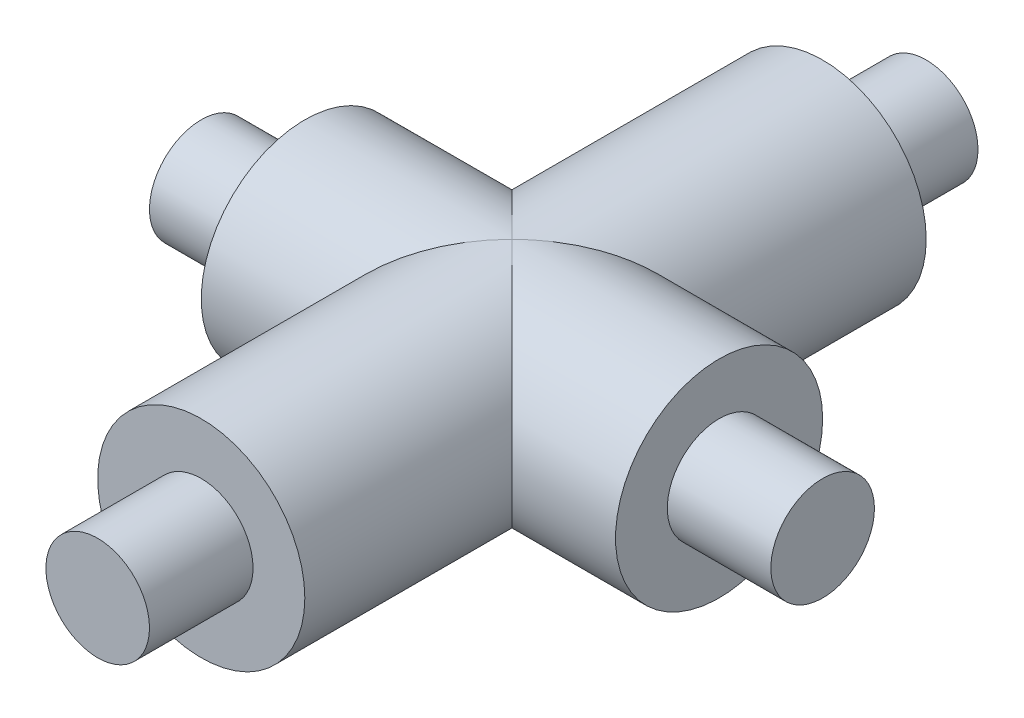
ISO-10303-21;
HEADER;
FILE_DESCRIPTION(('STEP AP214'),'2;1');
FILE_NAME('part.step','',(''),(''),'','','');
FILE_SCHEMA(('AUTOMOTIVE_DESIGN { 1 0 10303 214 1 1 1 1 }'));
ENDSEC;
DATA;
#1=APPLICATION_CONTEXT('core data for automotive mechanical design processes');
#2=APPLICATION_PROTOCOL_DEFINITION('international standard','automotive_design',2000,#1);
#3=PRODUCT_CONTEXT('',#1,'mechanical');
#4=PRODUCT('Part','Part','',(#3));
#5=PRODUCT_RELATED_PRODUCT_CATEGORY('part','',(#4));
#6=PRODUCT_DEFINITION_FORMATION('','',#4);
#7=PRODUCT_DEFINITION_CONTEXT('part definition',#1,'design');
#8=PRODUCT_DEFINITION('design','',#6,#7);
#9=PRODUCT_DEFINITION_SHAPE('','',#8);
#10=(LENGTH_UNIT() NAMED_UNIT(*) SI_UNIT(.MILLI.,.METRE.));
#11=(NAMED_UNIT(*) PLANE_ANGLE_UNIT() SI_UNIT($,.RADIAN.));
#12=(NAMED_UNIT(*) SI_UNIT($,.STERADIAN.) SOLID_ANGLE_UNIT());
#13=UNCERTAINTY_MEASURE_WITH_UNIT(LENGTH_MEASURE(1.E-05),#10,'distance_accuracy_value','');
#14=(GEOMETRIC_REPRESENTATION_CONTEXT(3) GLOBAL_UNCERTAINTY_ASSIGNED_CONTEXT((#13)) GLOBAL_UNIT_ASSIGNED_CONTEXT((#10,
#11,#12)) REPRESENTATION_CONTEXT('',''));
#15=CARTESIAN_POINT('',(0.,0.,0.));
#16=DIRECTION('',(0.,0.,1.));
#17=DIRECTION('',(1.,0.,0.));
#18=AXIS2_PLACEMENT_3D('',#15,#16,#17);
#19=CARTESIAN_POINT('',(0.,0.,-30.));
#20=DIRECTION('',(0.,0.,1.));
#21=DIRECTION('',(1.,0.,0.));
#22=AXIS2_PLACEMENT_3D('',#19,#20,#21);
#23=CYLINDRICAL_SURFACE('',#22,5.);
#24=CARTESIAN_POINT('',(0.,0.,-15.));
#25=DIRECTION('',(0.707106781186547,0.,0.707106781186547));
#26=DIRECTION('',(-0.707106781186547,0.,0.707106781186547));
#27=AXIS2_PLACEMENT_3D('',#24,#25,#26);
#28=ELLIPSE('',#27,7.07106781186547,5.);
#29=CARTESIAN_POINT('',(0.,-5.,-15.));
#30=VERTEX_POINT('',#29);
#31=CARTESIAN_POINT('',(0.,5.,-15.));
#32=VERTEX_POINT('',#31);
#33=EDGE_CURVE('E61',#30,#32,#28,.T.);
#34=ORIENTED_EDGE('',*,*,#33,.F.);
#35=CARTESIAN_POINT('',(0.,0.,-15.));
#36=DIRECTION('',(-0.707106781186547,0.,0.707106781186547));
#37=DIRECTION('',(0.707106781186547,0.,0.707106781186547));
#38=AXIS2_PLACEMENT_3D('',#35,#36,#37);
#39=ELLIPSE('',#38,7.07106781186547,5.);
#40=EDGE_CURVE('E59',#32,#30,#39,.T.);
#41=ORIENTED_EDGE('',*,*,#40,.F.);
#42=EDGE_LOOP('',(#34,#41));
#43=FACE_BOUND('',#42,.T.);
#44=CARTESIAN_POINT('',(0.,0.,-30.));
#45=DIRECTION('',(0.,0.,1.));
#46=DIRECTION('',(1.,0.,0.));
#47=AXIS2_PLACEMENT_3D('',#44,#45,#46);
#48=CIRCLE('',#47,5.);
#49=CARTESIAN_POINT('',(5.,0.,-30.));
#50=VERTEX_POINT('',#49);
#51=EDGE_CURVE('E71',#50,#50,#48,.T.);
#52=ORIENTED_EDGE('',*,*,#51,.T.);
#53=EDGE_LOOP('',(#52));
#54=FACE_BOUND('',#53,.T.);
#55=ADVANCED_FACE('F39',(#43,#54),#23,.T.);
#56=CARTESIAN_POINT('',(0.,0.,-30.));
#57=DIRECTION('',(0.,0.,1.));
#58=DIRECTION('',(1.,0.,0.));
#59=AXIS2_PLACEMENT_3D('',#56,#57,#58);
#60=PLANE('',#59);
#61=CARTESIAN_POINT('',(0.,0.,-30.));
#62=DIRECTION('',(0.,0.,1.));
#63=DIRECTION('',(1.,0.,0.));
#64=AXIS2_PLACEMENT_3D('',#61,#62,#63);
#65=CIRCLE('',#64,2.5);
#66=CARTESIAN_POINT('',(2.5,0.,-30.));
#67=VERTEX_POINT('',#66);
#68=EDGE_CURVE('E102',#67,#67,#65,.T.);
#69=ORIENTED_EDGE('',*,*,#68,.T.);
#70=EDGE_LOOP('',(#69));
#71=FACE_BOUND('',#70,.T.);
#72=ORIENTED_EDGE('',*,*,#51,.F.);
#73=EDGE_LOOP('',(#72));
#74=FACE_BOUND('',#73,.T.);
#75=ADVANCED_FACE('F127',(#71,#74),#60,.F.);
#76=CARTESIAN_POINT('',(10.,0.,-15.));
#77=DIRECTION('',(1.,0.,0.));
#78=DIRECTION('',(0.,0.,-1.));
#79=AXIS2_PLACEMENT_3D('',#76,#77,#78);
#80=PLANE('',#79);
#81=CARTESIAN_POINT('',(10.,0.,-15.));
#82=DIRECTION('',(1.,0.,0.));
#83=DIRECTION('',(0.,0.,-1.));
#84=AXIS2_PLACEMENT_3D('',#81,#82,#83);
#85=CIRCLE('',#84,2.5);
#86=CARTESIAN_POINT('',(10.,0.,-17.5));
#87=VERTEX_POINT('',#86);
#88=EDGE_CURVE('E47',#87,#87,#85,.T.);
#89=ORIENTED_EDGE('',*,*,#88,.F.);
#90=EDGE_LOOP('',(#89));
#91=FACE_BOUND('',#90,.T.);
#92=CARTESIAN_POINT('',(10.,0.,-15.));
#93=DIRECTION('',(1.,0.,0.));
#94=DIRECTION('',(0.,0.,-1.));
#95=AXIS2_PLACEMENT_3D('',#92,#93,#94);
#96=CIRCLE('',#95,5.);
#97=CARTESIAN_POINT('',(10.,0.,-20.));
#98=VERTEX_POINT('',#97);
#99=EDGE_CURVE('E86',#98,#98,#96,.T.);
#100=ORIENTED_EDGE('',*,*,#99,.T.);
#101=EDGE_LOOP('',(#100));
#102=FACE_BOUND('',#101,.T.);
#103=ADVANCED_FACE('F131',(#91,#102),#80,.T.);
#104=CARTESIAN_POINT('',(-10.,0.,-15.));
#105=DIRECTION('',(1.,0.,0.));
#106=DIRECTION('',(0.,0.,-1.));
#107=AXIS2_PLACEMENT_3D('',#104,#105,#106);
#108=CYLINDRICAL_SURFACE('',#107,5.);
#109=ORIENTED_EDGE('',*,*,#99,.F.);
#110=EDGE_LOOP('',(#109));
#111=FACE_BOUND('',#110,.T.);
#112=CARTESIAN_POINT('',(0.,0.,-15.));
#113=DIRECTION('',(-0.707106781186547,0.,0.707106781186547));
#114=DIRECTION('',(0.707106781186547,0.,0.707106781186547));
#115=AXIS2_PLACEMENT_3D('',#112,#113,#114);
#116=ELLIPSE('',#115,7.07106781186547,5.);
#117=EDGE_CURVE('E53',#32,#30,#116,.F.);
#118=ORIENTED_EDGE('',*,*,#117,.T.);
#119=ORIENTED_EDGE('',*,*,#33,.T.);
#120=EDGE_LOOP('',(#118,#119));
#121=FACE_BOUND('',#120,.T.);
#122=ADVANCED_FACE('F73',(#111,#121),#108,.T.);
#123=CARTESIAN_POINT('',(0.,0.,0.));
#124=DIRECTION('',(0.,0.,1.));
#125=DIRECTION('',(1.,0.,0.));
#126=AXIS2_PLACEMENT_3D('',#123,#124,#125);
#127=PLANE('',#126);
#128=CARTESIAN_POINT('',(0.,0.,0.));
#129=DIRECTION('',(0.,0.,1.));
#130=DIRECTION('',(1.,0.,0.));
#131=AXIS2_PLACEMENT_3D('',#128,#129,#130);
#132=CIRCLE('',#131,2.5);
#133=CARTESIAN_POINT('',(2.5,0.,0.));
#134=VERTEX_POINT('',#133);
#135=EDGE_CURVE('E11',#134,#134,#132,.T.);
#136=ORIENTED_EDGE('',*,*,#135,.F.);
#137=EDGE_LOOP('',(#136));
#138=FACE_BOUND('',#137,.T.);
#139=CARTESIAN_POINT('',(0.,0.,0.));
#140=DIRECTION('',(0.,0.,1.));
#141=DIRECTION('',(1.,0.,0.));
#142=AXIS2_PLACEMENT_3D('',#139,#140,#141);
#143=CIRCLE('',#142,5.);
#144=CARTESIAN_POINT('',(5.,0.,0.));
#145=VERTEX_POINT('',#144);
#146=EDGE_CURVE('E109',#145,#145,#143,.T.);
#147=ORIENTED_EDGE('',*,*,#146,.T.);
#148=EDGE_LOOP('',(#147));
#149=FACE_BOUND('',#148,.T.);
#150=ADVANCED_FACE('F117',(#138,#149),#127,.T.);
#151=CARTESIAN_POINT('',(0.,0.,-15.));
#152=DIRECTION('',(0.707106781186547,0.,0.707106781186547));
#153=DIRECTION('',(-0.707106781186547,0.,0.707106781186547));
#154=AXIS2_PLACEMENT_3D('',#151,#152,#153);
#155=ELLIPSE('',#154,7.07106781186547,5.);
#156=EDGE_CURVE('E69',#30,#32,#155,.F.);
#157=ORIENTED_EDGE('',*,*,#156,.F.);
#158=ORIENTED_EDGE('',*,*,#117,.F.);
#159=EDGE_LOOP('',(#157,#158));
#160=FACE_BOUND('',#159,.T.);
#161=ORIENTED_EDGE('',*,*,#146,.F.);
#162=EDGE_LOOP('',(#161));
#163=FACE_BOUND('',#162,.T.);
#164=ADVANCED_FACE('F67',(#160,#163),#23,.T.);
#165=ORIENTED_EDGE('',*,*,#40,.T.);
#166=ORIENTED_EDGE('',*,*,#156,.T.);
#167=EDGE_LOOP('',(#165,#166));
#168=FACE_BOUND('',#167,.T.);
#169=CARTESIAN_POINT('',(-10.,0.,-15.));
#170=DIRECTION('',(1.,0.,0.));
#171=DIRECTION('',(0.,0.,-1.));
#172=AXIS2_PLACEMENT_3D('',#169,#170,#171);
#173=CIRCLE('',#172,5.);
#174=CARTESIAN_POINT('',(-10.,0.,-20.));
#175=VERTEX_POINT('',#174);
#176=EDGE_CURVE('E93',#175,#175,#173,.T.);
#177=ORIENTED_EDGE('',*,*,#176,.T.);
#178=EDGE_LOOP('',(#177));
#179=FACE_BOUND('',#178,.T.);
#180=ADVANCED_FACE('F76',(#168,#179),#108,.T.);
#181=CARTESIAN_POINT('',(-10.,0.,-15.));
#182=DIRECTION('',(1.,0.,0.));
#183=DIRECTION('',(0.,0.,-1.));
#184=AXIS2_PLACEMENT_3D('',#181,#182,#183);
#185=PLANE('',#184);
#186=CARTESIAN_POINT('',(-10.,0.,-15.));
#187=DIRECTION('',(1.,0.,0.));
#188=DIRECTION('',(0.,0.,-1.));
#189=AXIS2_PLACEMENT_3D('',#186,#187,#188);
#190=CIRCLE('',#189,2.5);
#191=CARTESIAN_POINT('',(-10.,0.,-17.5));
#192=VERTEX_POINT('',#191);
#193=EDGE_CURVE('E83',#192,#192,#190,.T.);
#194=ORIENTED_EDGE('',*,*,#193,.T.);
#195=EDGE_LOOP('',(#194));
#196=FACE_BOUND('',#195,.T.);
#197=ORIENTED_EDGE('',*,*,#176,.F.);
#198=EDGE_LOOP('',(#197));
#199=FACE_BOUND('',#198,.T.);
#200=ADVANCED_FACE('F123',(#196,#199),#185,.F.);
#201=CARTESIAN_POINT('',(-15.,0.,-15.));
#202=DIRECTION('',(1.,0.,0.));
#203=DIRECTION('',(0.,0.,-1.));
#204=AXIS2_PLACEMENT_3D('',#201,#202,#203);
#205=PLANE('',#204);
#206=CARTESIAN_POINT('',(-15.,0.,-15.));
#207=DIRECTION('',(1.,0.,0.));
#208=DIRECTION('',(0.,0.,-1.));
#209=AXIS2_PLACEMENT_3D('',#206,#207,#208);
#210=CIRCLE('',#209,2.5);
#211=CARTESIAN_POINT('',(-15.,0.,-17.5));
#212=VERTEX_POINT('',#211);
#213=EDGE_CURVE('E87',#212,#212,#210,.T.);
#214=ORIENTED_EDGE('',*,*,#213,.F.);
#215=EDGE_LOOP('',(#214));
#216=FACE_BOUND('',#215,.T.);
#217=ADVANCED_FACE('F143',(#216),#205,.F.);
#218=CARTESIAN_POINT('',(-15.,0.,-15.));
#219=DIRECTION('',(1.,0.,0.));
#220=DIRECTION('',(0.,0.,-1.));
#221=AXIS2_PLACEMENT_3D('',#218,#219,#220);
#222=CYLINDRICAL_SURFACE('',#221,2.5);
#223=ORIENTED_EDGE('',*,*,#213,.T.);
#224=EDGE_LOOP('',(#223));
#225=FACE_BOUND('',#224,.T.);
#226=ORIENTED_EDGE('',*,*,#193,.F.);
#227=EDGE_LOOP('',(#226));
#228=FACE_BOUND('',#227,.T.);
#229=ADVANCED_FACE('F149',(#225,#228),#222,.T.);
#230=ORIENTED_EDGE('',*,*,#88,.T.);
#231=EDGE_LOOP('',(#230));
#232=FACE_BOUND('',#231,.T.);
#233=CARTESIAN_POINT('',(15.,0.,-15.));
#234=DIRECTION('',(1.,0.,0.));
#235=DIRECTION('',(0.,0.,-1.));
#236=AXIS2_PLACEMENT_3D('',#233,#234,#235);
#237=CIRCLE('',#236,2.5);
#238=CARTESIAN_POINT('',(15.,0.,-17.5));
#239=VERTEX_POINT('',#238);
#240=EDGE_CURVE('E96',#239,#239,#237,.T.);
#241=ORIENTED_EDGE('',*,*,#240,.F.);
#242=EDGE_LOOP('',(#241));
#243=FACE_BOUND('',#242,.T.);
#244=ADVANCED_FACE('F145',(#232,#243),#222,.T.);
#245=CARTESIAN_POINT('',(15.,0.,-15.));
#246=DIRECTION('',(1.,0.,0.));
#247=DIRECTION('',(0.,0.,-1.));
#248=AXIS2_PLACEMENT_3D('',#245,#246,#247);
#249=PLANE('',#248);
#250=ORIENTED_EDGE('',*,*,#240,.T.);
#251=EDGE_LOOP('',(#250));
#252=FACE_BOUND('',#251,.T.);
#253=ADVANCED_FACE('F148',(#252),#249,.T.);
#254=CARTESIAN_POINT('',(0.,0.,5.));
#255=DIRECTION('',(0.,0.,1.));
#256=DIRECTION('',(1.,0.,0.));
#257=AXIS2_PLACEMENT_3D('',#254,#255,#256);
#258=PLANE('',#257);
#259=CARTESIAN_POINT('',(0.,0.,5.));
#260=DIRECTION('',(0.,0.,1.));
#261=DIRECTION('',(1.,0.,0.));
#262=AXIS2_PLACEMENT_3D('',#259,#260,#261);
#263=CIRCLE('',#262,2.5);
#264=CARTESIAN_POINT('',(2.5,0.,5.));
#265=VERTEX_POINT('',#264);
#266=EDGE_CURVE('E173',#265,#265,#263,.T.);
#267=ORIENTED_EDGE('',*,*,#266,.T.);
#268=EDGE_LOOP('',(#267));
#269=FACE_BOUND('',#268,.T.);
#270=ADVANCED_FACE('F156',(#269),#258,.T.);
#271=CARTESIAN_POINT('',(0.,0.,-35.));
#272=DIRECTION('',(0.,0.,1.));
#273=DIRECTION('',(1.,0.,0.));
#274=AXIS2_PLACEMENT_3D('',#271,#272,#273);
#275=CYLINDRICAL_SURFACE('',#274,2.5);
#276=ORIENTED_EDGE('',*,*,#135,.T.);
#277=EDGE_LOOP('',(#276));
#278=FACE_BOUND('',#277,.T.);
#279=ORIENTED_EDGE('',*,*,#266,.F.);
#280=EDGE_LOOP('',(#279));
#281=FACE_BOUND('',#280,.T.);
#282=ADVANCED_FACE('F158',(#278,#281),#275,.T.);
#283=CARTESIAN_POINT('',(0.,0.,-35.));
#284=DIRECTION('',(0.,0.,1.));
#285=DIRECTION('',(1.,0.,0.));
#286=AXIS2_PLACEMENT_3D('',#283,#284,#285);
#287=CIRCLE('',#286,2.5);
#288=CARTESIAN_POINT('',(2.5,0.,-35.));
#289=VERTEX_POINT('',#288);
#290=EDGE_CURVE('E176',#289,#289,#287,.T.);
#291=ORIENTED_EDGE('',*,*,#290,.T.);
#292=EDGE_LOOP('',(#291));
#293=FACE_BOUND('',#292,.T.);
#294=ORIENTED_EDGE('',*,*,#68,.F.);
#295=EDGE_LOOP('',(#294));
#296=FACE_BOUND('',#295,.T.);
#297=ADVANCED_FACE('F161',(#293,#296),#275,.T.);
#298=CARTESIAN_POINT('',(0.,0.,-35.));
#299=DIRECTION('',(0.,0.,1.));
#300=DIRECTION('',(1.,0.,0.));
#301=AXIS2_PLACEMENT_3D('',#298,#299,#300);
#302=PLANE('',#301);
#303=ORIENTED_EDGE('',*,*,#290,.F.);
#304=EDGE_LOOP('',(#303));
#305=FACE_BOUND('',#304,.T.);
#306=ADVANCED_FACE('F163',(#305),#302,.F.);
#307=CLOSED_SHELL('',(#55,#75,#103,#122,#150,#164,#180,#200,#217,#229,#244,#253,#270,#282,#297,#306));
#308=MANIFOLD_SOLID_BREP('B2',#307);
#309=ADVANCED_BREP_SHAPE_REPRESENTATION('',(#18,#308),#14);
#310=SHAPE_DEFINITION_REPRESENTATION(#9,#309);
ENDSEC;
END-ISO-10303-21;
